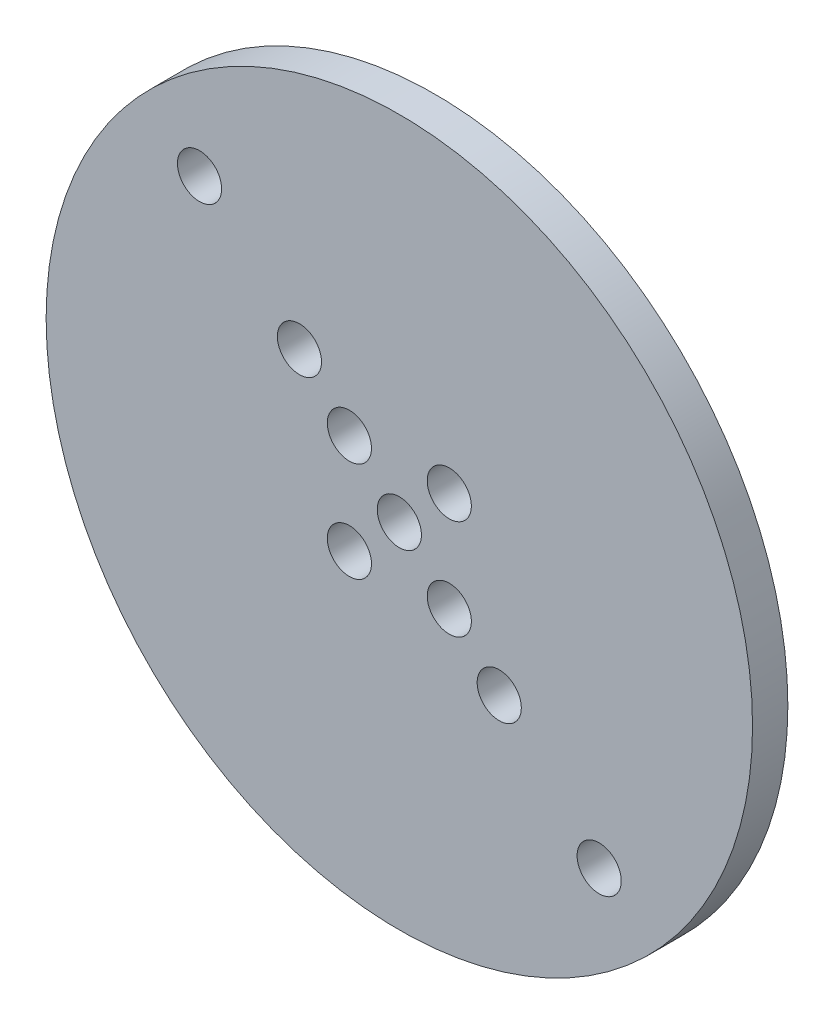
ISO-10303-21;
HEADER;
FILE_DESCRIPTION(('STEP AP214'),'2;1');
FILE_NAME('part.step','',(''),(''),'','','');
FILE_SCHEMA(('AUTOMOTIVE_DESIGN { 1 0 10303 214 1 1 1 1 }'));
ENDSEC;
DATA;
#1=APPLICATION_CONTEXT('core data for automotive mechanical design processes');
#2=APPLICATION_PROTOCOL_DEFINITION('international standard','automotive_design',2000,#1);
#3=PRODUCT_CONTEXT('',#1,'mechanical');
#4=PRODUCT('Part','Part','',(#3));
#5=PRODUCT_RELATED_PRODUCT_CATEGORY('part','',(#4));
#6=PRODUCT_DEFINITION_FORMATION('','',#4);
#7=PRODUCT_DEFINITION_CONTEXT('part definition',#1,'design');
#8=PRODUCT_DEFINITION('design','',#6,#7);
#9=PRODUCT_DEFINITION_SHAPE('','',#8);
#10=(LENGTH_UNIT() NAMED_UNIT(*) SI_UNIT(.MILLI.,.METRE.));
#11=(NAMED_UNIT(*) PLANE_ANGLE_UNIT() SI_UNIT($,.RADIAN.));
#12=(NAMED_UNIT(*) SI_UNIT($,.STERADIAN.) SOLID_ANGLE_UNIT());
#13=UNCERTAINTY_MEASURE_WITH_UNIT(LENGTH_MEASURE(1.E-05),#10,'distance_accuracy_value','');
#14=(GEOMETRIC_REPRESENTATION_CONTEXT(3) GLOBAL_UNCERTAINTY_ASSIGNED_CONTEXT((#13)) GLOBAL_UNIT_ASSIGNED_CONTEXT((#10,
#11,#12)) REPRESENTATION_CONTEXT('',''));
#15=CARTESIAN_POINT('',(0.,0.,0.));
#16=DIRECTION('',(0.,0.,1.));
#17=DIRECTION('',(1.,0.,0.));
#18=AXIS2_PLACEMENT_3D('',#15,#16,#17);
#19=CARTESIAN_POINT('',(0.,0.,6.35));
#20=DIRECTION('',(0.,0.,-1.));
#21=DIRECTION('',(-1.,0.,0.));
#22=AXIS2_PLACEMENT_3D('',#19,#20,#21);
#23=CYLINDRICAL_SURFACE('',#22,63.5);
#24=CARTESIAN_POINT('',(0.,0.,6.35));
#25=DIRECTION('',(0.,0.,1.));
#26=DIRECTION('',(1.,0.,0.));
#27=AXIS2_PLACEMENT_3D('',#24,#25,#26);
#28=CIRCLE('',#27,63.5);
#29=CARTESIAN_POINT('',(63.5,0.,6.35));
#30=VERTEX_POINT('',#29);
#31=EDGE_CURVE('E10',#30,#30,#28,.T.);
#32=ORIENTED_EDGE('',*,*,#31,.F.);
#33=EDGE_LOOP('',(#32));
#34=FACE_BOUND('',#33,.T.);
#35=CARTESIAN_POINT('',(0.,0.,0.));
#36=DIRECTION('',(0.,0.,1.));
#37=DIRECTION('',(1.,0.,0.));
#38=AXIS2_PLACEMENT_3D('',#35,#36,#37);
#39=CIRCLE('',#38,63.5);
#40=CARTESIAN_POINT('',(63.5,0.,0.));
#41=VERTEX_POINT('',#40);
#42=EDGE_CURVE('E34',#41,#41,#39,.T.);
#43=ORIENTED_EDGE('',*,*,#42,.T.);
#44=EDGE_LOOP('',(#43));
#45=FACE_BOUND('',#44,.T.);
#46=ADVANCED_FACE('F31',(#34,#45),#23,.T.);
#47=CARTESIAN_POINT('',(0.,0.,6.35));
#48=DIRECTION('',(0.,0.,1.));
#49=DIRECTION('',(1.,0.,0.));
#50=AXIS2_PLACEMENT_3D('',#47,#48,#49);
#51=PLANE('',#50);
#52=CARTESIAN_POINT('',(-35.9210244842766,35.9210244842766,6.35));
#53=DIRECTION('',(0.,0.,1.));
#54=DIRECTION('',(1.,0.,0.));
#55=AXIS2_PLACEMENT_3D('',#52,#53,#54);
#56=CIRCLE('',#55,3.96875);
#57=CARTESIAN_POINT('',(-31.9522744842766,35.9210244842766,6.35));
#58=VERTEX_POINT('',#57);
#59=EDGE_CURVE('E91',#58,#58,#56,.T.);
#60=ORIENTED_EDGE('',*,*,#59,.F.);
#61=EDGE_LOOP('',(#60));
#62=FACE_BOUND('',#61,.T.);
#63=CARTESIAN_POINT('',(-17.9605122421383,17.9605122421383,6.35));
#64=DIRECTION('',(0.,0.,1.));
#65=DIRECTION('',(1.,0.,0.));
#66=AXIS2_PLACEMENT_3D('',#63,#64,#65);
#67=CIRCLE('',#66,3.96875);
#68=CARTESIAN_POINT('',(-13.9917622421383,17.9605122421383,6.35));
#69=VERTEX_POINT('',#68);
#70=EDGE_CURVE('E85',#69,#69,#67,.T.);
#71=ORIENTED_EDGE('',*,*,#70,.F.);
#72=EDGE_LOOP('',(#71));
#73=FACE_BOUND('',#72,.T.);
#74=CARTESIAN_POINT('',(35.9210244842766,-35.9210244842766,6.35));
#75=DIRECTION('',(0.,0.,1.));
#76=DIRECTION('',(1.,0.,0.));
#77=AXIS2_PLACEMENT_3D('',#74,#75,#76);
#78=CIRCLE('',#77,3.96875);
#79=CARTESIAN_POINT('',(39.8897744842766,-35.9210244842766,6.35));
#80=VERTEX_POINT('',#79);
#81=EDGE_CURVE('E79',#80,#80,#78,.T.);
#82=ORIENTED_EDGE('',*,*,#81,.F.);
#83=EDGE_LOOP('',(#82));
#84=FACE_BOUND('',#83,.T.);
#85=CARTESIAN_POINT('',(17.9605122421383,-17.9605122421383,6.35));
#86=DIRECTION('',(0.,0.,1.));
#87=DIRECTION('',(1.,0.,0.));
#88=AXIS2_PLACEMENT_3D('',#85,#86,#87);
#89=CIRCLE('',#88,3.96875);
#90=CARTESIAN_POINT('',(21.9292622421383,-17.9605122421383,6.35));
#91=VERTEX_POINT('',#90);
#92=EDGE_CURVE('E73',#91,#91,#89,.T.);
#93=ORIENTED_EDGE('',*,*,#92,.F.);
#94=EDGE_LOOP('',(#93));
#95=FACE_BOUND('',#94,.T.);
#96=CARTESIAN_POINT('',(-8.98025612106915,-8.98025612106915,6.35));
#97=DIRECTION('',(0.,0.,1.));
#98=DIRECTION('',(1.,0.,0.));
#99=AXIS2_PLACEMENT_3D('',#96,#97,#98);
#100=CIRCLE('',#99,3.96875000000001);
#101=CARTESIAN_POINT('',(-5.01150612106914,-8.98025612106915,6.35));
#102=VERTEX_POINT('',#101);
#103=EDGE_CURVE('E67',#102,#102,#100,.T.);
#104=ORIENTED_EDGE('',*,*,#103,.F.);
#105=EDGE_LOOP('',(#104));
#106=FACE_BOUND('',#105,.T.);
#107=CARTESIAN_POINT('',(8.98025612106915,8.98025612106916,6.35));
#108=DIRECTION('',(0.,0.,1.));
#109=DIRECTION('',(1.,0.,0.));
#110=AXIS2_PLACEMENT_3D('',#107,#108,#109);
#111=CIRCLE('',#110,3.96874999999999);
#112=CARTESIAN_POINT('',(12.9490061210691,8.98025612106916,6.35));
#113=VERTEX_POINT('',#112);
#114=EDGE_CURVE('E61',#113,#113,#111,.T.);
#115=ORIENTED_EDGE('',*,*,#114,.F.);
#116=EDGE_LOOP('',(#115));
#117=FACE_BOUND('',#116,.T.);
#118=CARTESIAN_POINT('',(8.98025612106915,-8.98025612106915,6.35));
#119=DIRECTION('',(0.,0.,1.));
#120=DIRECTION('',(1.,0.,0.));
#121=AXIS2_PLACEMENT_3D('',#118,#119,#120);
#122=CIRCLE('',#121,3.96875);
#123=CARTESIAN_POINT('',(12.9490061210692,-8.98025612106915,6.35));
#124=VERTEX_POINT('',#123);
#125=EDGE_CURVE('E55',#124,#124,#122,.T.);
#126=ORIENTED_EDGE('',*,*,#125,.F.);
#127=EDGE_LOOP('',(#126));
#128=FACE_BOUND('',#127,.T.);
#129=CARTESIAN_POINT('',(-8.98025612106916,8.98025612106916,6.35));
#130=DIRECTION('',(0.,0.,1.));
#131=DIRECTION('',(1.,0.,0.));
#132=AXIS2_PLACEMENT_3D('',#129,#130,#131);
#133=CIRCLE('',#132,3.96875);
#134=CARTESIAN_POINT('',(-5.01150612106916,8.98025612106916,6.35));
#135=VERTEX_POINT('',#134);
#136=EDGE_CURVE('E49',#135,#135,#133,.T.);
#137=ORIENTED_EDGE('',*,*,#136,.F.);
#138=EDGE_LOOP('',(#137));
#139=FACE_BOUND('',#138,.T.);
#140=CARTESIAN_POINT('',(0.,0.,6.35));
#141=DIRECTION('',(0.,0.,1.));
#142=DIRECTION('',(1.,0.,0.));
#143=AXIS2_PLACEMENT_3D('',#140,#141,#142);
#144=CIRCLE('',#143,3.96875);
#145=CARTESIAN_POINT('',(3.96875,0.,6.35));
#146=VERTEX_POINT('',#145);
#147=EDGE_CURVE('E43',#146,#146,#144,.T.);
#148=ORIENTED_EDGE('',*,*,#147,.F.);
#149=EDGE_LOOP('',(#148));
#150=FACE_BOUND('',#149,.T.);
#151=ORIENTED_EDGE('',*,*,#31,.T.);
#152=EDGE_LOOP('',(#151));
#153=FACE_BOUND('',#152,.T.);
#154=ADVANCED_FACE('F107',(#62,#73,#84,#95,#106,#117,#128,#139,#150,#153),#51,.T.);
#155=CARTESIAN_POINT('',(0.,0.,0.));
#156=DIRECTION('',(0.,0.,1.));
#157=DIRECTION('',(1.,0.,0.));
#158=AXIS2_PLACEMENT_3D('',#155,#156,#157);
#159=PLANE('',#158);
#160=CARTESIAN_POINT('',(-35.9210244842766,35.9210244842766,0.));
#161=DIRECTION('',(0.,0.,1.));
#162=DIRECTION('',(1.,0.,0.));
#163=AXIS2_PLACEMENT_3D('',#160,#161,#162);
#164=CIRCLE('',#163,3.96875);
#165=CARTESIAN_POINT('',(-31.9522744842766,35.9210244842766,0.));
#166=VERTEX_POINT('',#165);
#167=EDGE_CURVE('E88',#166,#166,#164,.T.);
#168=ORIENTED_EDGE('',*,*,#167,.T.);
#169=EDGE_LOOP('',(#168));
#170=FACE_BOUND('',#169,.T.);
#171=CARTESIAN_POINT('',(-17.9605122421383,17.9605122421383,0.));
#172=DIRECTION('',(0.,0.,1.));
#173=DIRECTION('',(1.,0.,0.));
#174=AXIS2_PLACEMENT_3D('',#171,#172,#173);
#175=CIRCLE('',#174,3.96875);
#176=CARTESIAN_POINT('',(-13.9917622421383,17.9605122421383,0.));
#177=VERTEX_POINT('',#176);
#178=EDGE_CURVE('E82',#177,#177,#175,.T.);
#179=ORIENTED_EDGE('',*,*,#178,.T.);
#180=EDGE_LOOP('',(#179));
#181=FACE_BOUND('',#180,.T.);
#182=CARTESIAN_POINT('',(35.9210244842766,-35.9210244842766,0.));
#183=DIRECTION('',(0.,0.,1.));
#184=DIRECTION('',(1.,0.,0.));
#185=AXIS2_PLACEMENT_3D('',#182,#183,#184);
#186=CIRCLE('',#185,3.96875);
#187=CARTESIAN_POINT('',(39.8897744842766,-35.9210244842766,0.));
#188=VERTEX_POINT('',#187);
#189=EDGE_CURVE('E76',#188,#188,#186,.T.);
#190=ORIENTED_EDGE('',*,*,#189,.T.);
#191=EDGE_LOOP('',(#190));
#192=FACE_BOUND('',#191,.T.);
#193=CARTESIAN_POINT('',(17.9605122421383,-17.9605122421383,0.));
#194=DIRECTION('',(0.,0.,1.));
#195=DIRECTION('',(1.,0.,0.));
#196=AXIS2_PLACEMENT_3D('',#193,#194,#195);
#197=CIRCLE('',#196,3.96875);
#198=CARTESIAN_POINT('',(21.9292622421383,-17.9605122421383,0.));
#199=VERTEX_POINT('',#198);
#200=EDGE_CURVE('E70',#199,#199,#197,.T.);
#201=ORIENTED_EDGE('',*,*,#200,.T.);
#202=EDGE_LOOP('',(#201));
#203=FACE_BOUND('',#202,.T.);
#204=CARTESIAN_POINT('',(-8.98025612106915,-8.98025612106915,0.));
#205=DIRECTION('',(0.,0.,1.));
#206=DIRECTION('',(1.,0.,0.));
#207=AXIS2_PLACEMENT_3D('',#204,#205,#206);
#208=CIRCLE('',#207,3.96875000000001);
#209=CARTESIAN_POINT('',(-5.01150612106914,-8.98025612106915,0.));
#210=VERTEX_POINT('',#209);
#211=EDGE_CURVE('E64',#210,#210,#208,.T.);
#212=ORIENTED_EDGE('',*,*,#211,.T.);
#213=EDGE_LOOP('',(#212));
#214=FACE_BOUND('',#213,.T.);
#215=CARTESIAN_POINT('',(8.98025612106915,8.98025612106916,0.));
#216=DIRECTION('',(0.,0.,1.));
#217=DIRECTION('',(1.,0.,0.));
#218=AXIS2_PLACEMENT_3D('',#215,#216,#217);
#219=CIRCLE('',#218,3.96874999999999);
#220=CARTESIAN_POINT('',(12.9490061210691,8.98025612106916,0.));
#221=VERTEX_POINT('',#220);
#222=EDGE_CURVE('E58',#221,#221,#219,.T.);
#223=ORIENTED_EDGE('',*,*,#222,.T.);
#224=EDGE_LOOP('',(#223));
#225=FACE_BOUND('',#224,.T.);
#226=CARTESIAN_POINT('',(8.98025612106915,-8.98025612106915,0.));
#227=DIRECTION('',(0.,0.,1.));
#228=DIRECTION('',(1.,0.,0.));
#229=AXIS2_PLACEMENT_3D('',#226,#227,#228);
#230=CIRCLE('',#229,3.96875);
#231=CARTESIAN_POINT('',(12.9490061210692,-8.98025612106915,0.));
#232=VERTEX_POINT('',#231);
#233=EDGE_CURVE('E52',#232,#232,#230,.T.);
#234=ORIENTED_EDGE('',*,*,#233,.T.);
#235=EDGE_LOOP('',(#234));
#236=FACE_BOUND('',#235,.T.);
#237=CARTESIAN_POINT('',(-8.98025612106916,8.98025612106916,0.));
#238=DIRECTION('',(0.,0.,1.));
#239=DIRECTION('',(1.,0.,0.));
#240=AXIS2_PLACEMENT_3D('',#237,#238,#239);
#241=CIRCLE('',#240,3.96875);
#242=CARTESIAN_POINT('',(-5.01150612106916,8.98025612106916,0.));
#243=VERTEX_POINT('',#242);
#244=EDGE_CURVE('E46',#243,#243,#241,.T.);
#245=ORIENTED_EDGE('',*,*,#244,.T.);
#246=EDGE_LOOP('',(#245));
#247=FACE_BOUND('',#246,.T.);
#248=CARTESIAN_POINT('',(0.,0.,0.));
#249=DIRECTION('',(0.,0.,1.));
#250=DIRECTION('',(1.,0.,0.));
#251=AXIS2_PLACEMENT_3D('',#248,#249,#250);
#252=CIRCLE('',#251,3.96875);
#253=CARTESIAN_POINT('',(3.96875,0.,0.));
#254=VERTEX_POINT('',#253);
#255=EDGE_CURVE('E41',#254,#254,#252,.T.);
#256=ORIENTED_EDGE('',*,*,#255,.T.);
#257=EDGE_LOOP('',(#256));
#258=FACE_BOUND('',#257,.T.);
#259=ORIENTED_EDGE('',*,*,#42,.F.);
#260=EDGE_LOOP('',(#259));
#261=FACE_BOUND('',#260,.T.);
#262=ADVANCED_FACE('F97',(#170,#181,#192,#203,#214,#225,#236,#247,#258,#261),#159,.F.);
#263=CARTESIAN_POINT('',(0.,0.,0.));
#264=DIRECTION('',(0.,0.,1.));
#265=DIRECTION('',(1.,0.,0.));
#266=AXIS2_PLACEMENT_3D('',#263,#264,#265);
#267=CYLINDRICAL_SURFACE('',#266,3.96875);
#268=ORIENTED_EDGE('',*,*,#255,.F.);
#269=EDGE_LOOP('',(#268));
#270=FACE_BOUND('',#269,.T.);
#271=ORIENTED_EDGE('',*,*,#147,.T.);
#272=EDGE_LOOP('',(#271));
#273=FACE_BOUND('',#272,.T.);
#274=ADVANCED_FACE('F127',(#270,#273),#267,.F.);
#275=CARTESIAN_POINT('',(-8.98025612106916,8.98025612106916,0.));
#276=DIRECTION('',(0.,0.,1.));
#277=DIRECTION('',(1.,0.,0.));
#278=AXIS2_PLACEMENT_3D('',#275,#276,#277);
#279=CYLINDRICAL_SURFACE('',#278,3.96875);
#280=ORIENTED_EDGE('',*,*,#244,.F.);
#281=EDGE_LOOP('',(#280));
#282=FACE_BOUND('',#281,.T.);
#283=ORIENTED_EDGE('',*,*,#136,.T.);
#284=EDGE_LOOP('',(#283));
#285=FACE_BOUND('',#284,.T.);
#286=ADVANCED_FACE('F129',(#282,#285),#279,.F.);
#287=CARTESIAN_POINT('',(8.98025612106915,-8.98025612106915,0.));
#288=DIRECTION('',(0.,0.,1.));
#289=DIRECTION('',(1.,0.,0.));
#290=AXIS2_PLACEMENT_3D('',#287,#288,#289);
#291=CYLINDRICAL_SURFACE('',#290,3.96875);
#292=ORIENTED_EDGE('',*,*,#233,.F.);
#293=EDGE_LOOP('',(#292));
#294=FACE_BOUND('',#293,.T.);
#295=ORIENTED_EDGE('',*,*,#125,.T.);
#296=EDGE_LOOP('',(#295));
#297=FACE_BOUND('',#296,.T.);
#298=ADVANCED_FACE('F136',(#294,#297),#291,.F.);
#299=CARTESIAN_POINT('',(8.98025612106915,8.98025612106916,0.));
#300=DIRECTION('',(0.,0.,1.));
#301=DIRECTION('',(1.,0.,0.));
#302=AXIS2_PLACEMENT_3D('',#299,#300,#301);
#303=CYLINDRICAL_SURFACE('',#302,3.96874999999999);
#304=ORIENTED_EDGE('',*,*,#222,.F.);
#305=EDGE_LOOP('',(#304));
#306=FACE_BOUND('',#305,.T.);
#307=ORIENTED_EDGE('',*,*,#114,.T.);
#308=EDGE_LOOP('',(#307));
#309=FACE_BOUND('',#308,.T.);
#310=ADVANCED_FACE('F174',(#306,#309),#303,.F.);
#311=CARTESIAN_POINT('',(-8.98025612106915,-8.98025612106915,0.));
#312=DIRECTION('',(0.,0.,1.));
#313=DIRECTION('',(1.,0.,0.));
#314=AXIS2_PLACEMENT_3D('',#311,#312,#313);
#315=CYLINDRICAL_SURFACE('',#314,3.96875000000001);
#316=ORIENTED_EDGE('',*,*,#211,.F.);
#317=EDGE_LOOP('',(#316));
#318=FACE_BOUND('',#317,.T.);
#319=ORIENTED_EDGE('',*,*,#103,.T.);
#320=EDGE_LOOP('',(#319));
#321=FACE_BOUND('',#320,.T.);
#322=ADVANCED_FACE('F184',(#318,#321),#315,.F.);
#323=CARTESIAN_POINT('',(17.9605122421383,-17.9605122421383,0.));
#324=DIRECTION('',(0.,0.,1.));
#325=DIRECTION('',(1.,0.,0.));
#326=AXIS2_PLACEMENT_3D('',#323,#324,#325);
#327=CYLINDRICAL_SURFACE('',#326,3.96875);
#328=ORIENTED_EDGE('',*,*,#200,.F.);
#329=EDGE_LOOP('',(#328));
#330=FACE_BOUND('',#329,.T.);
#331=ORIENTED_EDGE('',*,*,#92,.T.);
#332=EDGE_LOOP('',(#331));
#333=FACE_BOUND('',#332,.T.);
#334=ADVANCED_FACE('F194',(#330,#333),#327,.F.);
#335=CARTESIAN_POINT('',(35.9210244842766,-35.9210244842766,0.));
#336=DIRECTION('',(0.,0.,1.));
#337=DIRECTION('',(1.,0.,0.));
#338=AXIS2_PLACEMENT_3D('',#335,#336,#337);
#339=CYLINDRICAL_SURFACE('',#338,3.96875);
#340=ORIENTED_EDGE('',*,*,#189,.F.);
#341=EDGE_LOOP('',(#340));
#342=FACE_BOUND('',#341,.T.);
#343=ORIENTED_EDGE('',*,*,#81,.T.);
#344=EDGE_LOOP('',(#343));
#345=FACE_BOUND('',#344,.T.);
#346=ADVANCED_FACE('F204',(#342,#345),#339,.F.);
#347=CARTESIAN_POINT('',(-17.9605122421383,17.9605122421383,0.));
#348=DIRECTION('',(0.,0.,1.));
#349=DIRECTION('',(1.,0.,0.));
#350=AXIS2_PLACEMENT_3D('',#347,#348,#349);
#351=CYLINDRICAL_SURFACE('',#350,3.96875);
#352=ORIENTED_EDGE('',*,*,#178,.F.);
#353=EDGE_LOOP('',(#352));
#354=FACE_BOUND('',#353,.T.);
#355=ORIENTED_EDGE('',*,*,#70,.T.);
#356=EDGE_LOOP('',(#355));
#357=FACE_BOUND('',#356,.T.);
#358=ADVANCED_FACE('F103',(#354,#357),#351,.F.);
#359=CARTESIAN_POINT('',(-35.9210244842766,35.9210244842766,0.));
#360=DIRECTION('',(0.,0.,1.));
#361=DIRECTION('',(1.,0.,0.));
#362=AXIS2_PLACEMENT_3D('',#359,#360,#361);
#363=CYLINDRICAL_SURFACE('',#362,3.96875);
#364=ORIENTED_EDGE('',*,*,#167,.F.);
#365=EDGE_LOOP('',(#364));
#366=FACE_BOUND('',#365,.T.);
#367=ORIENTED_EDGE('',*,*,#59,.T.);
#368=EDGE_LOOP('',(#367));
#369=FACE_BOUND('',#368,.T.);
#370=ADVANCED_FACE('F100',(#366,#369),#363,.F.);
#371=CLOSED_SHELL('',(#46,#154,#262,#274,#286,#298,#310,#322,#334,#346,#358,#370));
#372=MANIFOLD_SOLID_BREP('B2',#371);
#373=ADVANCED_BREP_SHAPE_REPRESENTATION('',(#18,#372),#14);
#374=SHAPE_DEFINITION_REPRESENTATION(#9,#373);
ENDSEC;
END-ISO-10303-21;
